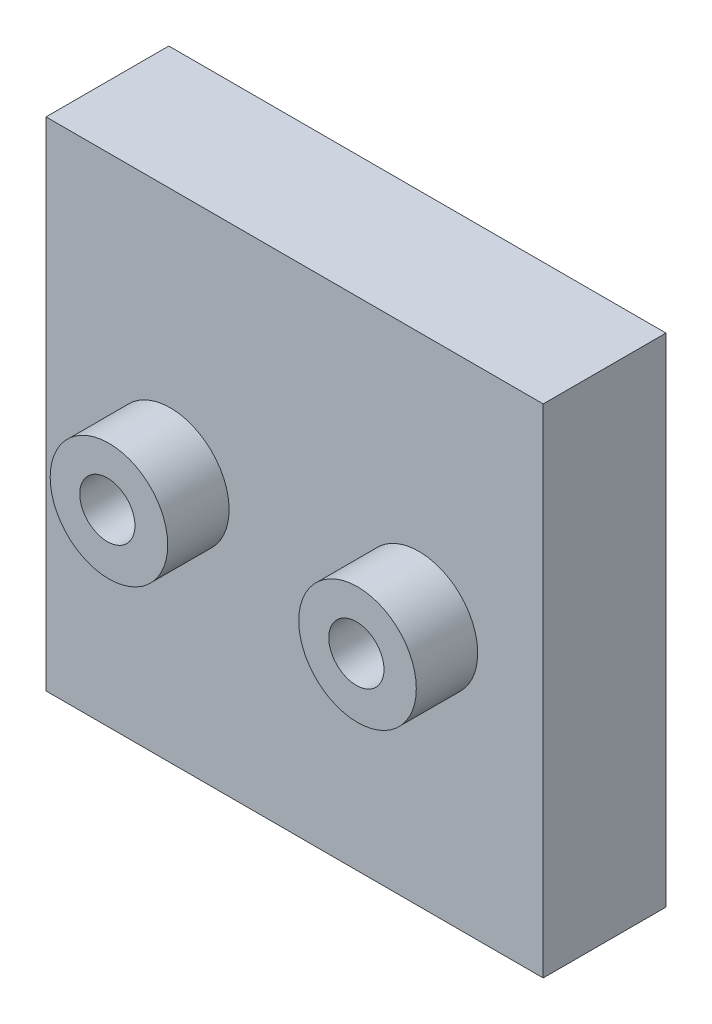
ISO-10303-21;
HEADER;
FILE_DESCRIPTION(('STEP AP214'),'2;1');
FILE_NAME('part.step','',(''),(''),'','','');
FILE_SCHEMA(('AUTOMOTIVE_DESIGN { 1 0 10303 214 1 1 1 1 }'));
ENDSEC;
DATA;
#1=APPLICATION_CONTEXT('core data for automotive mechanical design processes');
#2=APPLICATION_PROTOCOL_DEFINITION('international standard','automotive_design',2000,#1);
#3=PRODUCT_CONTEXT('',#1,'mechanical');
#4=PRODUCT('Part','Part','',(#3));
#5=PRODUCT_RELATED_PRODUCT_CATEGORY('part','',(#4));
#6=PRODUCT_DEFINITION_FORMATION('','',#4);
#7=PRODUCT_DEFINITION_CONTEXT('part definition',#1,'design');
#8=PRODUCT_DEFINITION('design','',#6,#7);
#9=PRODUCT_DEFINITION_SHAPE('','',#8);
#10=(LENGTH_UNIT() NAMED_UNIT(*) SI_UNIT(.MILLI.,.METRE.));
#11=(NAMED_UNIT(*) PLANE_ANGLE_UNIT() SI_UNIT($,.RADIAN.));
#12=(NAMED_UNIT(*) SI_UNIT($,.STERADIAN.) SOLID_ANGLE_UNIT());
#13=UNCERTAINTY_MEASURE_WITH_UNIT(LENGTH_MEASURE(1.E-05),#10,'distance_accuracy_value','');
#14=(GEOMETRIC_REPRESENTATION_CONTEXT(3) GLOBAL_UNCERTAINTY_ASSIGNED_CONTEXT((#13)) GLOBAL_UNIT_ASSIGNED_CONTEXT((#10,
#11,#12)) REPRESENTATION_CONTEXT('',''));
#15=CARTESIAN_POINT('',(0.,0.,0.));
#16=DIRECTION('',(0.,0.,1.));
#17=DIRECTION('',(1.,0.,0.));
#18=AXIS2_PLACEMENT_3D('',#15,#16,#17);
#19=CARTESIAN_POINT('',(-40.5,81.,-10.));
#20=DIRECTION('',(1.,0.,0.));
#21=DIRECTION('',(0.,0.,-1.));
#22=AXIS2_PLACEMENT_3D('',#19,#20,#21);
#23=PLANE('',#22);
#24=DIRECTION('',(0.,0.,1.));
#25=VECTOR('',#24,1.);
#26=CARTESIAN_POINT('',(-40.5,0.,-10.));
#27=LINE('',#26,#25);
#28=CARTESIAN_POINT('',(-40.5,0.,-10.));
#29=VERTEX_POINT('',#28);
#30=CARTESIAN_POINT('',(-40.5,0.,10.));
#31=VERTEX_POINT('',#30);
#32=EDGE_CURVE('E103',#29,#31,#27,.T.);
#33=ORIENTED_EDGE('',*,*,#32,.T.);
#34=DIRECTION('',(0.,-1.,0.));
#35=VECTOR('',#34,1.);
#36=CARTESIAN_POINT('',(-40.5,81.,10.));
#37=LINE('',#36,#35);
#38=CARTESIAN_POINT('',(-40.5,81.,10.));
#39=VERTEX_POINT('',#38);
#40=EDGE_CURVE('E95',#39,#31,#37,.T.);
#41=ORIENTED_EDGE('',*,*,#40,.F.);
#42=DIRECTION('',(0.,0.,1.));
#43=VECTOR('',#42,1.);
#44=CARTESIAN_POINT('',(-40.5,81.,-10.));
#45=LINE('',#44,#43);
#46=CARTESIAN_POINT('',(-40.5,81.,-10.));
#47=VERTEX_POINT('',#46);
#48=EDGE_CURVE('E86',#47,#39,#45,.T.);
#49=ORIENTED_EDGE('',*,*,#48,.F.);
#50=DIRECTION('',(0.,-1.,0.));
#51=VECTOR('',#50,1.);
#52=CARTESIAN_POINT('',(-40.5,81.,-10.));
#53=LINE('',#52,#51);
#54=EDGE_CURVE('E52',#47,#29,#53,.T.);
#55=ORIENTED_EDGE('',*,*,#54,.T.);
#56=EDGE_LOOP('',(#33,#41,#49,#55));
#57=FACE_BOUND('',#56,.T.);
#58=ADVANCED_FACE('F36',(#57),#23,.F.);
#59=CARTESIAN_POINT('',(-40.5,81.,10.));
#60=DIRECTION('',(0.,0.,-1.));
#61=DIRECTION('',(-1.,0.,0.));
#62=AXIS2_PLACEMENT_3D('',#59,#60,#61);
#63=PLANE('',#62);
#64=CARTESIAN_POINT('',(20.25,40.5,10.));
#65=DIRECTION('',(0.,0.,-1.));
#66=DIRECTION('',(-1.,0.,0.));
#67=AXIS2_PLACEMENT_3D('',#64,#65,#66);
#68=CIRCLE('',#67,9.57580000000001);
#69=CARTESIAN_POINT('',(10.6742,40.5,10.));
#70=VERTEX_POINT('',#69);
#71=EDGE_CURVE('E11',#70,#70,#68,.F.);
#72=ORIENTED_EDGE('',*,*,#71,.F.);
#73=EDGE_LOOP('',(#72));
#74=FACE_BOUND('',#73,.T.);
#75=CARTESIAN_POINT('',(-20.25,40.5,10.));
#76=DIRECTION('',(0.,0.,-1.));
#77=DIRECTION('',(-1.,0.,0.));
#78=AXIS2_PLACEMENT_3D('',#75,#76,#77);
#79=CIRCLE('',#78,9.5758);
#80=CARTESIAN_POINT('',(-29.8258,40.5,10.));
#81=VERTEX_POINT('',#80);
#82=EDGE_CURVE('E44',#81,#81,#79,.F.);
#83=ORIENTED_EDGE('',*,*,#82,.F.);
#84=EDGE_LOOP('',(#83));
#85=FACE_BOUND('',#84,.T.);
#86=DIRECTION('',(1.,0.,0.));
#87=VECTOR('',#86,1.);
#88=CARTESIAN_POINT('',(-40.5,0.,10.));
#89=LINE('',#88,#87);
#90=CARTESIAN_POINT('',(40.5,0.,10.));
#91=VERTEX_POINT('',#90);
#92=EDGE_CURVE('E92',#31,#91,#89,.T.);
#93=ORIENTED_EDGE('',*,*,#92,.T.);
#94=DIRECTION('',(0.,-1.,0.));
#95=VECTOR('',#94,1.);
#96=CARTESIAN_POINT('',(40.5,81.,10.));
#97=LINE('',#96,#95);
#98=CARTESIAN_POINT('',(40.5,81.,10.));
#99=VERTEX_POINT('',#98);
#100=EDGE_CURVE('E90',#99,#91,#97,.T.);
#101=ORIENTED_EDGE('',*,*,#100,.F.);
#102=DIRECTION('',(1.,0.,0.));
#103=VECTOR('',#102,1.);
#104=CARTESIAN_POINT('',(-40.5,81.,10.));
#105=LINE('',#104,#103);
#106=EDGE_CURVE('E78',#39,#99,#105,.T.);
#107=ORIENTED_EDGE('',*,*,#106,.F.);
#108=ORIENTED_EDGE('',*,*,#40,.T.);
#109=EDGE_LOOP('',(#93,#101,#107,#108));
#110=FACE_BOUND('',#109,.T.);
#111=ADVANCED_FACE('F91',(#74,#85,#110),#63,.F.);
#112=CARTESIAN_POINT('',(40.5,81.,-10.));
#113=DIRECTION('',(1.,0.,0.));
#114=DIRECTION('',(0.,0.,-1.));
#115=AXIS2_PLACEMENT_3D('',#112,#113,#114);
#116=PLANE('',#115);
#117=DIRECTION('',(0.,0.,1.));
#118=VECTOR('',#117,1.);
#119=CARTESIAN_POINT('',(40.5,0.,-10.));
#120=LINE('',#119,#118);
#121=CARTESIAN_POINT('',(40.5,0.,-10.));
#122=VERTEX_POINT('',#121);
#123=EDGE_CURVE('E107',#122,#91,#120,.T.);
#124=ORIENTED_EDGE('',*,*,#123,.F.);
#125=DIRECTION('',(0.,-1.,0.));
#126=VECTOR('',#125,1.);
#127=CARTESIAN_POINT('',(40.5,81.,-10.));
#128=LINE('',#127,#126);
#129=CARTESIAN_POINT('',(40.5,81.,-10.));
#130=VERTEX_POINT('',#129);
#131=EDGE_CURVE('E66',#130,#122,#128,.T.);
#132=ORIENTED_EDGE('',*,*,#131,.F.);
#133=DIRECTION('',(0.,0.,1.));
#134=VECTOR('',#133,1.);
#135=CARTESIAN_POINT('',(40.5,81.,-10.));
#136=LINE('',#135,#134);
#137=EDGE_CURVE('E85',#130,#99,#136,.T.);
#138=ORIENTED_EDGE('',*,*,#137,.T.);
#139=ORIENTED_EDGE('',*,*,#100,.T.);
#140=EDGE_LOOP('',(#124,#132,#138,#139));
#141=FACE_BOUND('',#140,.T.);
#142=ADVANCED_FACE('F97',(#141),#116,.T.);
#143=CARTESIAN_POINT('',(-40.5,81.,-10.));
#144=DIRECTION('',(0.,0.,-1.));
#145=DIRECTION('',(-1.,0.,0.));
#146=AXIS2_PLACEMENT_3D('',#143,#144,#145);
#147=PLANE('',#146);
#148=DIRECTION('',(1.,0.,0.));
#149=VECTOR('',#148,1.);
#150=CARTESIAN_POINT('',(-40.5,0.,-10.));
#151=LINE('',#150,#149);
#152=EDGE_CURVE('E109',#29,#122,#151,.T.);
#153=ORIENTED_EDGE('',*,*,#152,.F.);
#154=ORIENTED_EDGE('',*,*,#54,.F.);
#155=DIRECTION('',(1.,0.,0.));
#156=VECTOR('',#155,1.);
#157=CARTESIAN_POINT('',(-40.5,81.,-10.));
#158=LINE('',#157,#156);
#159=EDGE_CURVE('E98',#47,#130,#158,.T.);
#160=ORIENTED_EDGE('',*,*,#159,.T.);
#161=ORIENTED_EDGE('',*,*,#131,.T.);
#162=EDGE_LOOP('',(#153,#154,#160,#161));
#163=FACE_BOUND('',#162,.T.);
#164=ADVANCED_FACE('F125',(#163),#147,.T.);
#165=CARTESIAN_POINT('',(0.,81.,0.));
#166=DIRECTION('',(0.,1.,0.));
#167=DIRECTION('',(0.,0.,1.));
#168=AXIS2_PLACEMENT_3D('',#165,#166,#167);
#169=PLANE('',#168);
#170=ORIENTED_EDGE('',*,*,#48,.T.);
#171=ORIENTED_EDGE('',*,*,#106,.T.);
#172=ORIENTED_EDGE('',*,*,#137,.F.);
#173=ORIENTED_EDGE('',*,*,#159,.F.);
#174=EDGE_LOOP('',(#170,#171,#172,#173));
#175=FACE_BOUND('',#174,.T.);
#176=ADVANCED_FACE('F82',(#175),#169,.T.);
#177=CARTESIAN_POINT('',(0.,0.,0.));
#178=DIRECTION('',(0.,1.,0.));
#179=DIRECTION('',(0.,0.,1.));
#180=AXIS2_PLACEMENT_3D('',#177,#178,#179);
#181=PLANE('',#180);
#182=ORIENTED_EDGE('',*,*,#32,.F.);
#183=ORIENTED_EDGE('',*,*,#152,.T.);
#184=ORIENTED_EDGE('',*,*,#123,.T.);
#185=ORIENTED_EDGE('',*,*,#92,.F.);
#186=EDGE_LOOP('',(#182,#183,#184,#185));
#187=FACE_BOUND('',#186,.T.);
#188=ADVANCED_FACE('F131',(#187),#181,.F.);
#189=CARTESIAN_POINT('',(-20.25,40.5,20.));
#190=DIRECTION('',(0.,0.,-1.));
#191=DIRECTION('',(-1.,0.,0.));
#192=AXIS2_PLACEMENT_3D('',#189,#190,#191);
#193=CYLINDRICAL_SURFACE('',#192,9.5758);
#194=CARTESIAN_POINT('',(-20.25,40.5,20.));
#195=DIRECTION('',(0.,0.,1.));
#196=DIRECTION('',(1.,0.,0.));
#197=AXIS2_PLACEMENT_3D('',#194,#195,#196);
#198=CIRCLE('',#197,9.5758);
#199=CARTESIAN_POINT('',(-10.6742,40.5,20.));
#200=VERTEX_POINT('',#199);
#201=EDGE_CURVE('E105',#200,#200,#198,.T.);
#202=ORIENTED_EDGE('',*,*,#201,.F.);
#203=EDGE_LOOP('',(#202));
#204=FACE_BOUND('',#203,.T.);
#205=ORIENTED_EDGE('',*,*,#82,.T.);
#206=EDGE_LOOP('',(#205));
#207=FACE_BOUND('',#206,.T.);
#208=ADVANCED_FACE('F117',(#204,#207),#193,.T.);
#209=CARTESIAN_POINT('',(-20.25,40.5,20.));
#210=DIRECTION('',(0.,0.,1.));
#211=DIRECTION('',(1.,0.,0.));
#212=AXIS2_PLACEMENT_3D('',#209,#210,#211);
#213=PLANE('',#212);
#214=CARTESIAN_POINT('',(-20.5108539341231,40.5563484998191,20.));
#215=DIRECTION('',(0.,0.,1.));
#216=DIRECTION('',(1.,0.,0.));
#217=AXIS2_PLACEMENT_3D('',#214,#215,#216);
#218=CIRCLE('',#217,4.4958);
#219=CARTESIAN_POINT('',(-16.0150539341231,40.5563484998191,20.));
#220=VERTEX_POINT('',#219);
#221=EDGE_CURVE('E173',#220,#220,#218,.T.);
#222=ORIENTED_EDGE('',*,*,#221,.F.);
#223=EDGE_LOOP('',(#222));
#224=FACE_BOUND('',#223,.T.);
#225=ORIENTED_EDGE('',*,*,#201,.T.);
#226=EDGE_LOOP('',(#225));
#227=FACE_BOUND('',#226,.T.);
#228=ADVANCED_FACE('F139',(#224,#227),#213,.T.);
#229=CARTESIAN_POINT('',(20.25,40.5,20.));
#230=DIRECTION('',(0.,0.,-1.));
#231=DIRECTION('',(-1.,0.,0.));
#232=AXIS2_PLACEMENT_3D('',#229,#230,#231);
#233=CYLINDRICAL_SURFACE('',#232,9.57580000000001);
#234=CARTESIAN_POINT('',(20.25,40.5,20.));
#235=DIRECTION('',(0.,0.,1.));
#236=DIRECTION('',(1.,0.,0.));
#237=AXIS2_PLACEMENT_3D('',#234,#235,#236);
#238=CIRCLE('',#237,9.57580000000001);
#239=CARTESIAN_POINT('',(29.8258,40.5,20.));
#240=VERTEX_POINT('',#239);
#241=EDGE_CURVE('E172',#240,#240,#238,.T.);
#242=ORIENTED_EDGE('',*,*,#241,.F.);
#243=EDGE_LOOP('',(#242));
#244=FACE_BOUND('',#243,.T.);
#245=ORIENTED_EDGE('',*,*,#71,.T.);
#246=EDGE_LOOP('',(#245));
#247=FACE_BOUND('',#246,.T.);
#248=ADVANCED_FACE('F143',(#244,#247),#233,.T.);
#249=CARTESIAN_POINT('',(20.25,40.5,20.));
#250=DIRECTION('',(0.,0.,1.));
#251=DIRECTION('',(1.,0.,0.));
#252=AXIS2_PLACEMENT_3D('',#249,#250,#251);
#253=PLANE('',#252);
#254=CARTESIAN_POINT('',(20.060065935571,40.5563484998191,20.));
#255=DIRECTION('',(0.,0.,1.));
#256=DIRECTION('',(1.,0.,0.));
#257=AXIS2_PLACEMENT_3D('',#254,#255,#256);
#258=CIRCLE('',#257,4.4958);
#259=CARTESIAN_POINT('',(24.555865935571,40.5563484998191,20.));
#260=VERTEX_POINT('',#259);
#261=EDGE_CURVE('E183',#260,#260,#258,.T.);
#262=ORIENTED_EDGE('',*,*,#261,.F.);
#263=EDGE_LOOP('',(#262));
#264=FACE_BOUND('',#263,.T.);
#265=ORIENTED_EDGE('',*,*,#241,.T.);
#266=EDGE_LOOP('',(#265));
#267=FACE_BOUND('',#266,.T.);
#268=ADVANCED_FACE('F147',(#264,#267),#253,.T.);
#269=CARTESIAN_POINT('',(20.060065935571,40.5563484998191,10.));
#270=DIRECTION('',(0.,0.,1.));
#271=DIRECTION('',(1.,0.,0.));
#272=AXIS2_PLACEMENT_3D('',#269,#270,#271);
#273=CYLINDRICAL_SURFACE('',#272,4.4958);
#274=CARTESIAN_POINT('',(20.060065935571,40.5563484998191,10.));
#275=DIRECTION('',(0.,0.,1.));
#276=DIRECTION('',(1.,0.,0.));
#277=AXIS2_PLACEMENT_3D('',#274,#275,#276);
#278=CIRCLE('',#277,4.4958);
#279=CARTESIAN_POINT('',(24.555865935571,40.5563484998191,10.));
#280=VERTEX_POINT('',#279);
#281=EDGE_CURVE('E178',#280,#280,#278,.T.);
#282=ORIENTED_EDGE('',*,*,#281,.F.);
#283=EDGE_LOOP('',(#282));
#284=FACE_BOUND('',#283,.T.);
#285=ORIENTED_EDGE('',*,*,#261,.T.);
#286=EDGE_LOOP('',(#285));
#287=FACE_BOUND('',#286,.T.);
#288=ADVANCED_FACE('F151',(#284,#287),#273,.F.);
#289=CARTESIAN_POINT('',(20.060065935571,40.5563484998191,10.));
#290=DIRECTION('',(0.,0.,1.));
#291=DIRECTION('',(1.,0.,0.));
#292=AXIS2_PLACEMENT_3D('',#289,#290,#291);
#293=PLANE('',#292);
#294=ORIENTED_EDGE('',*,*,#281,.T.);
#295=EDGE_LOOP('',(#294));
#296=FACE_BOUND('',#295,.T.);
#297=ADVANCED_FACE('F155',(#296),#293,.T.);
#298=CARTESIAN_POINT('',(-20.5108539341231,40.5563484998191,10.));
#299=DIRECTION('',(0.,0.,1.));
#300=DIRECTION('',(1.,0.,0.));
#301=AXIS2_PLACEMENT_3D('',#298,#299,#300);
#302=CYLINDRICAL_SURFACE('',#301,4.4958);
#303=CARTESIAN_POINT('',(-20.5108539341231,40.5563484998191,10.));
#304=DIRECTION('',(0.,0.,1.));
#305=DIRECTION('',(1.,0.,0.));
#306=AXIS2_PLACEMENT_3D('',#303,#304,#305);
#307=CIRCLE('',#306,4.4958);
#308=CARTESIAN_POINT('',(-16.0150539341231,40.5563484998191,10.));
#309=VERTEX_POINT('',#308);
#310=EDGE_CURVE('E171',#309,#309,#307,.T.);
#311=ORIENTED_EDGE('',*,*,#310,.F.);
#312=EDGE_LOOP('',(#311));
#313=FACE_BOUND('',#312,.T.);
#314=ORIENTED_EDGE('',*,*,#221,.T.);
#315=EDGE_LOOP('',(#314));
#316=FACE_BOUND('',#315,.T.);
#317=ADVANCED_FACE('F159',(#313,#316),#302,.F.);
#318=CARTESIAN_POINT('',(-20.5108539341231,40.5563484998191,10.));
#319=DIRECTION('',(0.,0.,1.));
#320=DIRECTION('',(1.,0.,0.));
#321=AXIS2_PLACEMENT_3D('',#318,#319,#320);
#322=PLANE('',#321);
#323=ORIENTED_EDGE('',*,*,#310,.T.);
#324=EDGE_LOOP('',(#323));
#325=FACE_BOUND('',#324,.T.);
#326=ADVANCED_FACE('F163',(#325),#322,.T.);
#327=CLOSED_SHELL('',(#58,#111,#142,#164,#176,#188,#208,#228,#248,#268,#288,#297,#317,#326));
#328=MANIFOLD_SOLID_BREP('B2',#327);
#329=ADVANCED_BREP_SHAPE_REPRESENTATION('',(#18,#328),#14);
#330=SHAPE_DEFINITION_REPRESENTATION(#9,#329);
ENDSEC;
END-ISO-10303-21;
